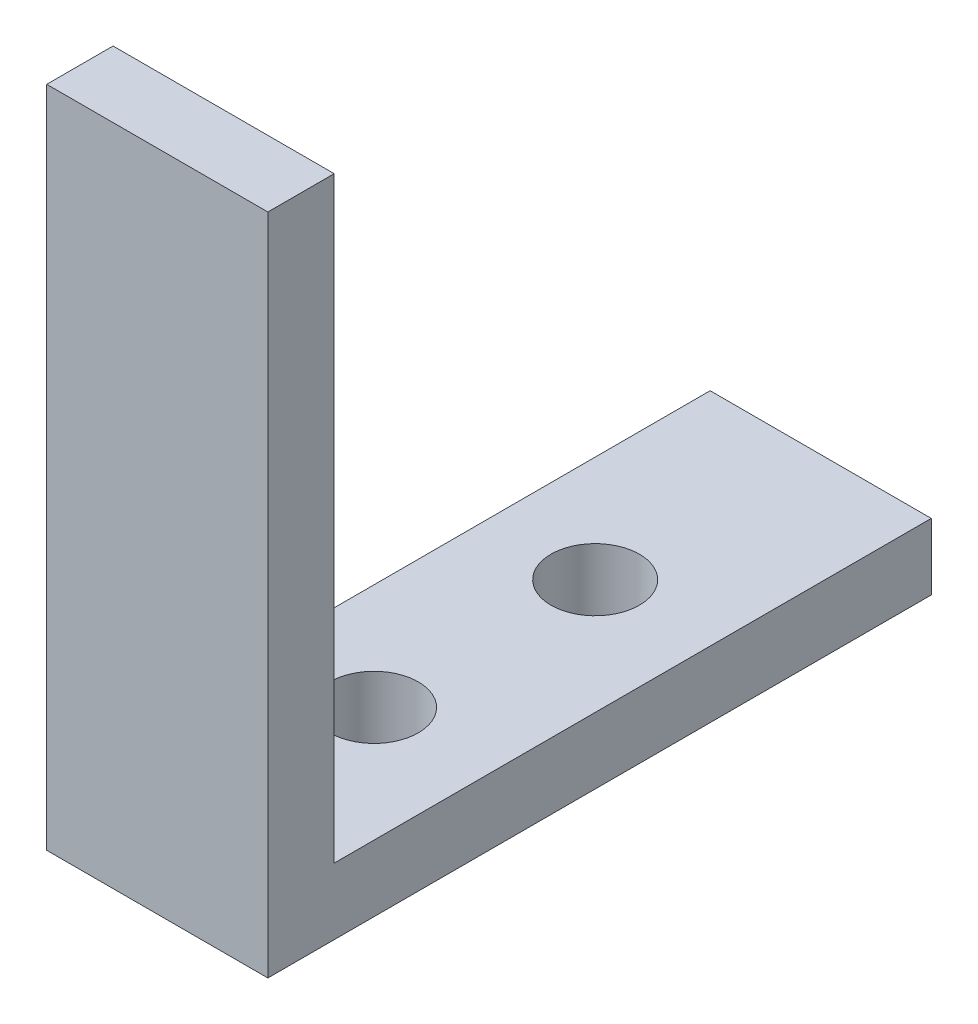
ISO-10303-21;
HEADER;
FILE_DESCRIPTION(('STEP AP214'),'2;1');
FILE_NAME('part.step','',(''),(''),'','','');
FILE_SCHEMA(('AUTOMOTIVE_DESIGN { 1 0 10303 214 1 1 1 1 }'));
ENDSEC;
DATA;
#1=APPLICATION_CONTEXT('core data for automotive mechanical design processes');
#2=APPLICATION_PROTOCOL_DEFINITION('international standard','automotive_design',2000,#1);
#3=PRODUCT_CONTEXT('',#1,'mechanical');
#4=PRODUCT('Part','Part','',(#3));
#5=PRODUCT_RELATED_PRODUCT_CATEGORY('part','',(#4));
#6=PRODUCT_DEFINITION_FORMATION('','',#4);
#7=PRODUCT_DEFINITION_CONTEXT('part definition',#1,'design');
#8=PRODUCT_DEFINITION('design','',#6,#7);
#9=PRODUCT_DEFINITION_SHAPE('','',#8);
#10=(LENGTH_UNIT() NAMED_UNIT(*) SI_UNIT(.MILLI.,.METRE.));
#11=(NAMED_UNIT(*) PLANE_ANGLE_UNIT() SI_UNIT($,.RADIAN.));
#12=(NAMED_UNIT(*) SI_UNIT($,.STERADIAN.) SOLID_ANGLE_UNIT());
#13=UNCERTAINTY_MEASURE_WITH_UNIT(LENGTH_MEASURE(1.E-05),#10,'distance_accuracy_value','');
#14=(GEOMETRIC_REPRESENTATION_CONTEXT(3) GLOBAL_UNCERTAINTY_ASSIGNED_CONTEXT((#13)) GLOBAL_UNIT_ASSIGNED_CONTEXT((#10,
#11,#12)) REPRESENTATION_CONTEXT('',''));
#15=CARTESIAN_POINT('',(0.,0.,0.));
#16=DIRECTION('',(0.,0.,1.));
#17=DIRECTION('',(1.,0.,0.));
#18=AXIS2_PLACEMENT_3D('',#15,#16,#17);
#19=CARTESIAN_POINT('',(10.,30.,-3.));
#20=DIRECTION('',(0.,-1.,0.));
#21=DIRECTION('',(0.,0.,-1.));
#22=AXIS2_PLACEMENT_3D('',#19,#20,#21);
#23=PLANE('',#22);
#24=DIRECTION('',(0.,0.,1.));
#25=VECTOR('',#24,1.);
#26=CARTESIAN_POINT('',(0.,30.,-3.));
#27=LINE('',#26,#25);
#28=CARTESIAN_POINT('',(0.,30.,-3.));
#29=VERTEX_POINT('',#28);
#30=CARTESIAN_POINT('',(0.,30.,0.));
#31=VERTEX_POINT('',#30);
#32=EDGE_CURVE('E116',#29,#31,#27,.T.);
#33=ORIENTED_EDGE('',*,*,#32,.T.);
#34=DIRECTION('',(-1.,0.,0.));
#35=VECTOR('',#34,1.);
#36=CARTESIAN_POINT('',(10.,30.,0.));
#37=LINE('',#36,#35);
#38=CARTESIAN_POINT('',(10.,30.,0.));
#39=VERTEX_POINT('',#38);
#40=EDGE_CURVE('E11',#39,#31,#37,.T.);
#41=ORIENTED_EDGE('',*,*,#40,.F.);
#42=DIRECTION('',(0.,0.,1.));
#43=VECTOR('',#42,1.);
#44=CARTESIAN_POINT('',(10.,30.,-3.));
#45=LINE('',#44,#43);
#46=CARTESIAN_POINT('',(10.,30.,-3.));
#47=VERTEX_POINT('',#46);
#48=EDGE_CURVE('E127',#47,#39,#45,.T.);
#49=ORIENTED_EDGE('',*,*,#48,.F.);
#50=DIRECTION('',(-1.,0.,0.));
#51=VECTOR('',#50,1.);
#52=CARTESIAN_POINT('',(10.,30.,-3.));
#53=LINE('',#52,#51);
#54=EDGE_CURVE('E112',#47,#29,#53,.T.);
#55=ORIENTED_EDGE('',*,*,#54,.T.);
#56=EDGE_LOOP('',(#33,#41,#49,#55));
#57=FACE_BOUND('',#56,.T.);
#58=ADVANCED_FACE('F32',(#57),#23,.F.);
#59=CARTESIAN_POINT('',(10.,30.,0.));
#60=DIRECTION('',(0.,0.,-1.));
#61=DIRECTION('',(0.,1.,0.));
#62=AXIS2_PLACEMENT_3D('',#59,#60,#61);
#63=PLANE('',#62);
#64=DIRECTION('',(0.,-1.,0.));
#65=VECTOR('',#64,1.);
#66=CARTESIAN_POINT('',(0.,30.,0.));
#67=LINE('',#66,#65);
#68=CARTESIAN_POINT('',(0.,0.,0.));
#69=VERTEX_POINT('',#68);
#70=EDGE_CURVE('E119',#31,#69,#67,.T.);
#71=ORIENTED_EDGE('',*,*,#70,.T.);
#72=DIRECTION('',(-1.,0.,0.));
#73=VECTOR('',#72,1.);
#74=CARTESIAN_POINT('',(10.,0.,0.));
#75=LINE('',#74,#73);
#76=CARTESIAN_POINT('',(10.,0.,0.));
#77=VERTEX_POINT('',#76);
#78=EDGE_CURVE('E40',#77,#69,#75,.T.);
#79=ORIENTED_EDGE('',*,*,#78,.F.);
#80=DIRECTION('',(0.,-1.,0.));
#81=VECTOR('',#80,1.);
#82=CARTESIAN_POINT('',(10.,30.,0.));
#83=LINE('',#82,#81);
#84=EDGE_CURVE('E85',#39,#77,#83,.T.);
#85=ORIENTED_EDGE('',*,*,#84,.F.);
#86=ORIENTED_EDGE('',*,*,#40,.T.);
#87=EDGE_LOOP('',(#71,#79,#85,#86));
#88=FACE_BOUND('',#87,.T.);
#89=ADVANCED_FACE('F152',(#88),#63,.F.);
#90=CARTESIAN_POINT('',(10.,0.,0.));
#91=DIRECTION('',(0.,1.,0.));
#92=DIRECTION('',(0.,0.,1.));
#93=AXIS2_PLACEMENT_3D('',#90,#91,#92);
#94=PLANE('',#93);
#95=CARTESIAN_POINT('',(4.80196141256783,0.,-20.));
#96=DIRECTION('',(0.,1.,0.));
#97=DIRECTION('',(0.,0.,1.));
#98=AXIS2_PLACEMENT_3D('',#95,#96,#97);
#99=CIRCLE('',#98,2.);
#100=CARTESIAN_POINT('',(4.80196141256783,0.,-18.));
#101=VERTEX_POINT('',#100);
#102=EDGE_CURVE('E217',#101,#101,#99,.T.);
#103=ORIENTED_EDGE('',*,*,#102,.T.);
#104=EDGE_LOOP('',(#103));
#105=FACE_BOUND('',#104,.T.);
#106=CARTESIAN_POINT('',(4.80196141256783,0.,-10.));
#107=DIRECTION('',(0.,1.,0.));
#108=DIRECTION('',(0.,0.,1.));
#109=AXIS2_PLACEMENT_3D('',#106,#107,#108);
#110=CIRCLE('',#109,2.);
#111=CARTESIAN_POINT('',(4.80196141256783,0.,-8.));
#112=VERTEX_POINT('',#111);
#113=EDGE_CURVE('E120',#112,#112,#110,.T.);
#114=ORIENTED_EDGE('',*,*,#113,.T.);
#115=EDGE_LOOP('',(#114));
#116=FACE_BOUND('',#115,.T.);
#117=DIRECTION('',(0.,0.,-1.));
#118=VECTOR('',#117,1.);
#119=CARTESIAN_POINT('',(0.,0.,0.));
#120=LINE('',#119,#118);
#121=CARTESIAN_POINT('',(0.,0.,-30.));
#122=VERTEX_POINT('',#121);
#123=EDGE_CURVE('E122',#69,#122,#120,.T.);
#124=ORIENTED_EDGE('',*,*,#123,.T.);
#125=DIRECTION('',(-1.,0.,0.));
#126=VECTOR('',#125,1.);
#127=CARTESIAN_POINT('',(10.,0.,-30.));
#128=LINE('',#127,#126);
#129=CARTESIAN_POINT('',(10.,0.,-30.));
#130=VERTEX_POINT('',#129);
#131=EDGE_CURVE('E107',#130,#122,#128,.T.);
#132=ORIENTED_EDGE('',*,*,#131,.F.);
#133=DIRECTION('',(0.,0.,-1.));
#134=VECTOR('',#133,1.);
#135=CARTESIAN_POINT('',(10.,0.,0.));
#136=LINE('',#135,#134);
#137=EDGE_CURVE('E98',#77,#130,#136,.T.);
#138=ORIENTED_EDGE('',*,*,#137,.F.);
#139=ORIENTED_EDGE('',*,*,#78,.T.);
#140=EDGE_LOOP('',(#124,#132,#138,#139));
#141=FACE_BOUND('',#140,.T.);
#142=ADVANCED_FACE('F133',(#105,#116,#141),#94,.F.);
#143=CARTESIAN_POINT('',(10.,0.,-30.));
#144=DIRECTION('',(0.,0.,1.));
#145=DIRECTION('',(1.,0.,0.));
#146=AXIS2_PLACEMENT_3D('',#143,#144,#145);
#147=PLANE('',#146);
#148=DIRECTION('',(0.,1.,0.));
#149=VECTOR('',#148,1.);
#150=CARTESIAN_POINT('',(0.,0.,-30.));
#151=LINE('',#150,#149);
#152=CARTESIAN_POINT('',(0.,3.,-30.));
#153=VERTEX_POINT('',#152);
#154=EDGE_CURVE('E106',#122,#153,#151,.T.);
#155=ORIENTED_EDGE('',*,*,#154,.T.);
#156=DIRECTION('',(-1.,0.,0.));
#157=VECTOR('',#156,1.);
#158=CARTESIAN_POINT('',(10.,3.,-30.));
#159=LINE('',#158,#157);
#160=CARTESIAN_POINT('',(10.,3.,-30.));
#161=VERTEX_POINT('',#160);
#162=EDGE_CURVE('E103',#161,#153,#159,.T.);
#163=ORIENTED_EDGE('',*,*,#162,.F.);
#164=DIRECTION('',(0.,1.,0.));
#165=VECTOR('',#164,1.);
#166=CARTESIAN_POINT('',(10.,0.,-30.));
#167=LINE('',#166,#165);
#168=EDGE_CURVE('E92',#130,#161,#167,.T.);
#169=ORIENTED_EDGE('',*,*,#168,.F.);
#170=ORIENTED_EDGE('',*,*,#131,.T.);
#171=EDGE_LOOP('',(#155,#163,#169,#170));
#172=FACE_BOUND('',#171,.T.);
#173=ADVANCED_FACE('F104',(#172),#147,.F.);
#174=CARTESIAN_POINT('',(10.,3.,-30.));
#175=DIRECTION('',(0.,-1.,0.));
#176=DIRECTION('',(0.,0.,-1.));
#177=AXIS2_PLACEMENT_3D('',#174,#175,#176);
#178=PLANE('',#177);
#179=CARTESIAN_POINT('',(4.80196141256783,3.,-20.));
#180=DIRECTION('',(0.,1.,0.));
#181=DIRECTION('',(0.,0.,1.));
#182=AXIS2_PLACEMENT_3D('',#179,#180,#181);
#183=CIRCLE('',#182,2.);
#184=CARTESIAN_POINT('',(4.80196141256783,3.,-18.));
#185=VERTEX_POINT('',#184);
#186=EDGE_CURVE('E220',#185,#185,#183,.T.);
#187=ORIENTED_EDGE('',*,*,#186,.F.);
#188=EDGE_LOOP('',(#187));
#189=FACE_BOUND('',#188,.T.);
#190=CARTESIAN_POINT('',(4.80196141256783,3.,-10.));
#191=DIRECTION('',(0.,1.,0.));
#192=DIRECTION('',(0.,0.,1.));
#193=AXIS2_PLACEMENT_3D('',#190,#191,#192);
#194=CIRCLE('',#193,2.);
#195=CARTESIAN_POINT('',(4.80196141256783,3.,-8.));
#196=VERTEX_POINT('',#195);
#197=EDGE_CURVE('E222',#196,#196,#194,.T.);
#198=ORIENTED_EDGE('',*,*,#197,.F.);
#199=EDGE_LOOP('',(#198));
#200=FACE_BOUND('',#199,.T.);
#201=DIRECTION('',(0.,0.,1.));
#202=VECTOR('',#201,1.);
#203=CARTESIAN_POINT('',(0.,3.,-30.));
#204=LINE('',#203,#202);
#205=CARTESIAN_POINT('',(0.,3.,-3.));
#206=VERTEX_POINT('',#205);
#207=EDGE_CURVE('E71',#153,#206,#204,.T.);
#208=ORIENTED_EDGE('',*,*,#207,.T.);
#209=DIRECTION('',(-1.,0.,0.));
#210=VECTOR('',#209,1.);
#211=CARTESIAN_POINT('',(10.,3.,-3.));
#212=LINE('',#211,#210);
#213=CARTESIAN_POINT('',(10.,3.,-3.));
#214=VERTEX_POINT('',#213);
#215=EDGE_CURVE('E108',#214,#206,#212,.T.);
#216=ORIENTED_EDGE('',*,*,#215,.F.);
#217=DIRECTION('',(0.,0.,1.));
#218=VECTOR('',#217,1.);
#219=CARTESIAN_POINT('',(10.,3.,-30.));
#220=LINE('',#219,#218);
#221=EDGE_CURVE('E96',#161,#214,#220,.T.);
#222=ORIENTED_EDGE('',*,*,#221,.F.);
#223=ORIENTED_EDGE('',*,*,#162,.T.);
#224=EDGE_LOOP('',(#208,#216,#222,#223));
#225=FACE_BOUND('',#224,.T.);
#226=ADVANCED_FACE('F110',(#189,#200,#225),#178,.F.);
#227=CARTESIAN_POINT('',(10.,3.,-3.));
#228=DIRECTION('',(0.,0.,1.));
#229=DIRECTION('',(1.,0.,0.));
#230=AXIS2_PLACEMENT_3D('',#227,#228,#229);
#231=PLANE('',#230);
#232=DIRECTION('',(0.,1.,0.));
#233=VECTOR('',#232,1.);
#234=CARTESIAN_POINT('',(0.,3.,-3.));
#235=LINE('',#234,#233);
#236=EDGE_CURVE('E77',#206,#29,#235,.T.);
#237=ORIENTED_EDGE('',*,*,#236,.T.);
#238=ORIENTED_EDGE('',*,*,#54,.F.);
#239=DIRECTION('',(0.,1.,0.));
#240=VECTOR('',#239,1.);
#241=CARTESIAN_POINT('',(10.,3.,-3.));
#242=LINE('',#241,#240);
#243=EDGE_CURVE('E48',#214,#47,#242,.T.);
#244=ORIENTED_EDGE('',*,*,#243,.F.);
#245=ORIENTED_EDGE('',*,*,#215,.T.);
#246=EDGE_LOOP('',(#237,#238,#244,#245));
#247=FACE_BOUND('',#246,.T.);
#248=ADVANCED_FACE('F140',(#247),#231,.F.);
#249=CARTESIAN_POINT('',(10.,0.,0.));
#250=DIRECTION('',(1.,0.,0.));
#251=DIRECTION('',(0.,0.,-1.));
#252=AXIS2_PLACEMENT_3D('',#249,#250,#251);
#253=PLANE('',#252);
#254=ORIENTED_EDGE('',*,*,#48,.T.);
#255=ORIENTED_EDGE('',*,*,#84,.T.);
#256=ORIENTED_EDGE('',*,*,#137,.T.);
#257=ORIENTED_EDGE('',*,*,#168,.T.);
#258=ORIENTED_EDGE('',*,*,#221,.T.);
#259=ORIENTED_EDGE('',*,*,#243,.T.);
#260=EDGE_LOOP('',(#254,#255,#256,#257,#258,#259));
#261=FACE_BOUND('',#260,.T.);
#262=ADVANCED_FACE('F94',(#261),#253,.T.);
#263=CARTESIAN_POINT('',(0.,0.,0.));
#264=DIRECTION('',(1.,0.,0.));
#265=DIRECTION('',(0.,0.,-1.));
#266=AXIS2_PLACEMENT_3D('',#263,#264,#265);
#267=PLANE('',#266);
#268=ORIENTED_EDGE('',*,*,#32,.F.);
#269=ORIENTED_EDGE('',*,*,#236,.F.);
#270=ORIENTED_EDGE('',*,*,#207,.F.);
#271=ORIENTED_EDGE('',*,*,#154,.F.);
#272=ORIENTED_EDGE('',*,*,#123,.F.);
#273=ORIENTED_EDGE('',*,*,#70,.F.);
#274=EDGE_LOOP('',(#268,#269,#270,#271,#272,#273));
#275=FACE_BOUND('',#274,.T.);
#276=ADVANCED_FACE('F136',(#275),#267,.F.);
#277=CARTESIAN_POINT('',(4.80196141256783,0.,-10.));
#278=DIRECTION('',(0.,1.,0.));
#279=DIRECTION('',(0.,0.,1.));
#280=AXIS2_PLACEMENT_3D('',#277,#278,#279);
#281=CYLINDRICAL_SURFACE('',#280,2.);
#282=ORIENTED_EDGE('',*,*,#113,.F.);
#283=EDGE_LOOP('',(#282));
#284=FACE_BOUND('',#283,.T.);
#285=ORIENTED_EDGE('',*,*,#197,.T.);
#286=EDGE_LOOP('',(#285));
#287=FACE_BOUND('',#286,.T.);
#288=ADVANCED_FACE('F180',(#284,#287),#281,.F.);
#289=CARTESIAN_POINT('',(4.80196141256783,0.,-20.));
#290=DIRECTION('',(0.,1.,0.));
#291=DIRECTION('',(0.,0.,1.));
#292=AXIS2_PLACEMENT_3D('',#289,#290,#291);
#293=CYLINDRICAL_SURFACE('',#292,2.);
#294=ORIENTED_EDGE('',*,*,#102,.F.);
#295=EDGE_LOOP('',(#294));
#296=FACE_BOUND('',#295,.T.);
#297=ORIENTED_EDGE('',*,*,#186,.T.);
#298=EDGE_LOOP('',(#297));
#299=FACE_BOUND('',#298,.T.);
#300=ADVANCED_FACE('F185',(#296,#299),#293,.F.);
#301=CLOSED_SHELL('',(#58,#89,#142,#173,#226,#248,#262,#276,#288,#300));
#302=MANIFOLD_SOLID_BREP('B2',#301);
#303=ADVANCED_BREP_SHAPE_REPRESENTATION('',(#18,#302),#14);
#304=SHAPE_DEFINITION_REPRESENTATION(#9,#303);
ENDSEC;
END-ISO-10303-21;
